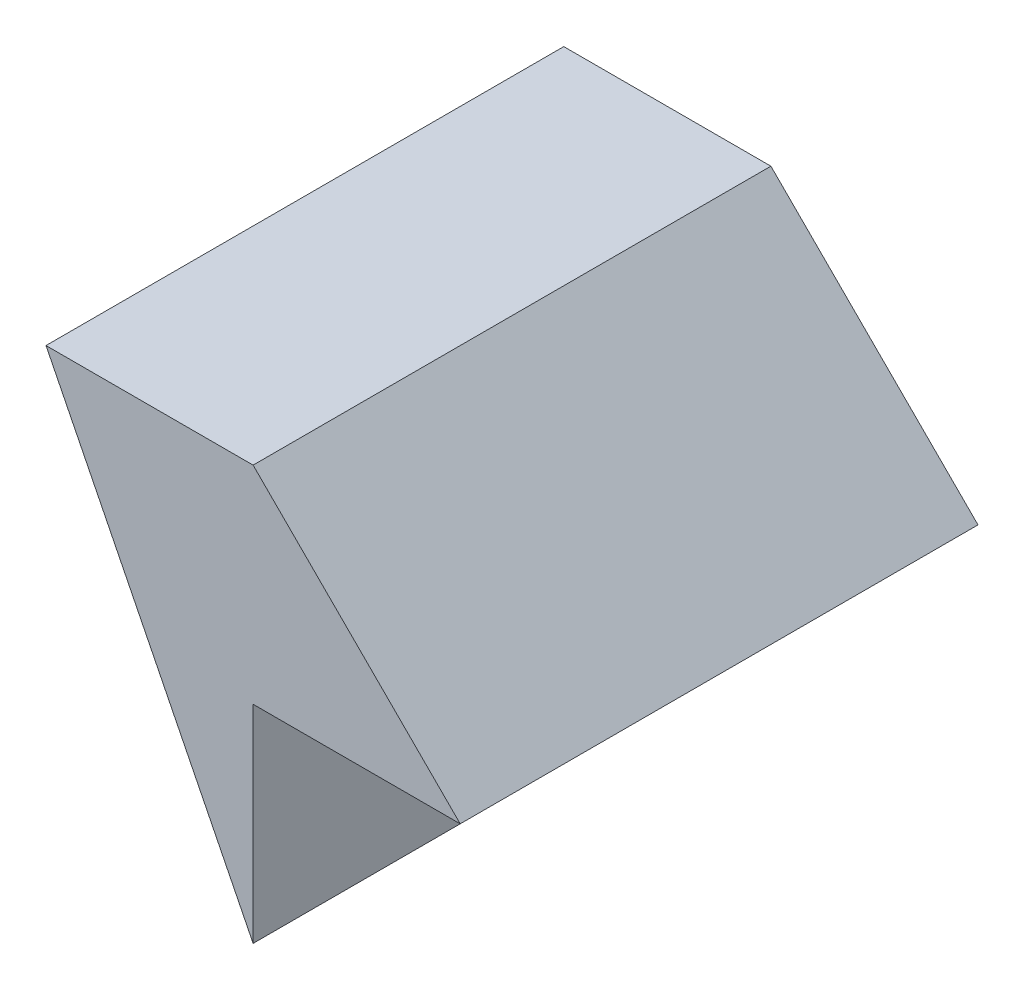
ISO-10303-21;
HEADER;
FILE_DESCRIPTION(('STEP AP214'),'2;1');
FILE_NAME('part.step','',(''),(''),'','','');
FILE_SCHEMA(('AUTOMOTIVE_DESIGN { 1 0 10303 214 1 1 1 1 }'));
ENDSEC;
DATA;
#1=APPLICATION_CONTEXT('core data for automotive mechanical design processes');
#2=APPLICATION_PROTOCOL_DEFINITION('international standard','automotive_design',2000,#1);
#3=PRODUCT_CONTEXT('',#1,'mechanical');
#4=PRODUCT('Part','Part','',(#3));
#5=PRODUCT_RELATED_PRODUCT_CATEGORY('part','',(#4));
#6=PRODUCT_DEFINITION_FORMATION('','',#4);
#7=PRODUCT_DEFINITION_CONTEXT('part definition',#1,'design');
#8=PRODUCT_DEFINITION('design','',#6,#7);
#9=PRODUCT_DEFINITION_SHAPE('','',#8);
#10=(LENGTH_UNIT() NAMED_UNIT(*) SI_UNIT(.MILLI.,.METRE.));
#11=(NAMED_UNIT(*) PLANE_ANGLE_UNIT() SI_UNIT($,.RADIAN.));
#12=(NAMED_UNIT(*) SI_UNIT($,.STERADIAN.) SOLID_ANGLE_UNIT());
#13=UNCERTAINTY_MEASURE_WITH_UNIT(LENGTH_MEASURE(1.E-05),#10,'distance_accuracy_value','');
#14=(GEOMETRIC_REPRESENTATION_CONTEXT(3) GLOBAL_UNCERTAINTY_ASSIGNED_CONTEXT((#13)) GLOBAL_UNIT_ASSIGNED_CONTEXT((#10,
#11,#12)) REPRESENTATION_CONTEXT('',''));
#15=CARTESIAN_POINT('',(0.,0.,0.));
#16=DIRECTION('',(0.,0.,1.));
#17=DIRECTION('',(1.,0.,0.));
#18=AXIS2_PLACEMENT_3D('',#15,#16,#17);
#19=CARTESIAN_POINT('',(0.,-10.,25.));
#20=DIRECTION('',(0.894427190999916,0.447213595499958,0.));
#21=DIRECTION('',(-0.447213595499958,0.894427190999916,0.));
#22=AXIS2_PLACEMENT_3D('',#19,#20,#21);
#23=PLANE('',#22);
#24=DIRECTION('',(0.447213595499958,-0.894427190999916,0.));
#25=VECTOR('',#24,1.);
#26=CARTESIAN_POINT('',(0.,-10.,0.));
#27=LINE('',#26,#25);
#28=CARTESIAN_POINT('',(-10.,10.,0.));
#29=VERTEX_POINT('',#28);
#30=CARTESIAN_POINT('',(0.,-10.,0.));
#31=VERTEX_POINT('',#30);
#32=EDGE_CURVE('E107',#29,#31,#27,.T.);
#33=ORIENTED_EDGE('',*,*,#32,.T.);
#34=DIRECTION('',(0.,0.,-1.));
#35=VECTOR('',#34,1.);
#36=CARTESIAN_POINT('',(0.,-10.,25.));
#37=LINE('',#36,#35);
#38=CARTESIAN_POINT('',(0.,-10.,25.));
#39=VERTEX_POINT('',#38);
#40=EDGE_CURVE('E11',#39,#31,#37,.T.);
#41=ORIENTED_EDGE('',*,*,#40,.F.);
#42=DIRECTION('',(0.447213595499958,-0.894427190999916,0.));
#43=VECTOR('',#42,1.);
#44=CARTESIAN_POINT('',(0.,-10.,25.));
#45=LINE('',#44,#43);
#46=CARTESIAN_POINT('',(-10.,10.,25.));
#47=VERTEX_POINT('',#46);
#48=EDGE_CURVE('E115',#47,#39,#45,.T.);
#49=ORIENTED_EDGE('',*,*,#48,.F.);
#50=DIRECTION('',(0.,0.,-1.));
#51=VECTOR('',#50,1.);
#52=CARTESIAN_POINT('',(-10.,10.,25.));
#53=LINE('',#52,#51);
#54=EDGE_CURVE('E103',#47,#29,#53,.T.);
#55=ORIENTED_EDGE('',*,*,#54,.T.);
#56=EDGE_LOOP('',(#33,#41,#49,#55));
#57=FACE_BOUND('',#56,.T.);
#58=ADVANCED_FACE('F33',(#57),#23,.F.);
#59=CARTESIAN_POINT('',(0.,0.,25.));
#60=DIRECTION('',(-1.,0.,0.));
#61=DIRECTION('',(0.,-1.,0.));
#62=AXIS2_PLACEMENT_3D('',#59,#60,#61);
#63=PLANE('',#62);
#64=DIRECTION('',(0.,1.,0.));
#65=VECTOR('',#64,1.);
#66=CARTESIAN_POINT('',(0.,0.,0.));
#67=LINE('',#66,#65);
#68=CARTESIAN_POINT('',(0.,0.,0.));
#69=VERTEX_POINT('',#68);
#70=EDGE_CURVE('E110',#31,#69,#67,.T.);
#71=ORIENTED_EDGE('',*,*,#70,.T.);
#72=DIRECTION('',(0.,0.,-1.));
#73=VECTOR('',#72,1.);
#74=CARTESIAN_POINT('',(0.,0.,25.));
#75=LINE('',#74,#73);
#76=CARTESIAN_POINT('',(0.,0.,25.));
#77=VERTEX_POINT('',#76);
#78=EDGE_CURVE('E41',#77,#69,#75,.T.);
#79=ORIENTED_EDGE('',*,*,#78,.F.);
#80=DIRECTION('',(0.,1.,0.));
#81=VECTOR('',#80,1.);
#82=CARTESIAN_POINT('',(0.,0.,25.));
#83=LINE('',#82,#81);
#84=EDGE_CURVE('E83',#39,#77,#83,.T.);
#85=ORIENTED_EDGE('',*,*,#84,.F.);
#86=ORIENTED_EDGE('',*,*,#40,.T.);
#87=EDGE_LOOP('',(#71,#79,#85,#86));
#88=FACE_BOUND('',#87,.T.);
#89=ADVANCED_FACE('F134',(#88),#63,.F.);
#90=CARTESIAN_POINT('',(10.,0.,25.));
#91=DIRECTION('',(0.,1.,0.));
#92=DIRECTION('',(-1.,0.,0.));
#93=AXIS2_PLACEMENT_3D('',#90,#91,#92);
#94=PLANE('',#93);
#95=DIRECTION('',(1.,0.,0.));
#96=VECTOR('',#95,1.);
#97=CARTESIAN_POINT('',(10.,0.,0.));
#98=LINE('',#97,#96);
#99=CARTESIAN_POINT('',(10.,0.,0.));
#100=VERTEX_POINT('',#99);
#101=EDGE_CURVE('E98',#69,#100,#98,.T.);
#102=ORIENTED_EDGE('',*,*,#101,.T.);
#103=DIRECTION('',(0.,0.,-1.));
#104=VECTOR('',#103,1.);
#105=CARTESIAN_POINT('',(10.,0.,25.));
#106=LINE('',#105,#104);
#107=CARTESIAN_POINT('',(10.,0.,25.));
#108=VERTEX_POINT('',#107);
#109=EDGE_CURVE('E95',#108,#100,#106,.T.);
#110=ORIENTED_EDGE('',*,*,#109,.F.);
#111=DIRECTION('',(1.,0.,0.));
#112=VECTOR('',#111,1.);
#113=CARTESIAN_POINT('',(10.,0.,25.));
#114=LINE('',#113,#112);
#115=EDGE_CURVE('E87',#77,#108,#114,.T.);
#116=ORIENTED_EDGE('',*,*,#115,.F.);
#117=ORIENTED_EDGE('',*,*,#78,.T.);
#118=EDGE_LOOP('',(#102,#110,#116,#117));
#119=FACE_BOUND('',#118,.T.);
#120=ADVANCED_FACE('F96',(#119),#94,.F.);
#121=CARTESIAN_POINT('',(0.,10.,25.));
#122=DIRECTION('',(-0.707106781186547,-0.707106781186548,0.));
#123=DIRECTION('',(0.707106781186548,-0.707106781186547,0.));
#124=AXIS2_PLACEMENT_3D('',#121,#122,#123);
#125=PLANE('',#124);
#126=DIRECTION('',(-0.707106781186548,0.707106781186547,0.));
#127=VECTOR('',#126,1.);
#128=CARTESIAN_POINT('',(0.,10.,0.));
#129=LINE('',#128,#127);
#130=CARTESIAN_POINT('',(0.,10.,0.));
#131=VERTEX_POINT('',#130);
#132=EDGE_CURVE('E69',#100,#131,#129,.T.);
#133=ORIENTED_EDGE('',*,*,#132,.T.);
#134=DIRECTION('',(0.,0.,-1.));
#135=VECTOR('',#134,1.);
#136=CARTESIAN_POINT('',(0.,10.,25.));
#137=LINE('',#136,#135);
#138=CARTESIAN_POINT('',(0.,10.,25.));
#139=VERTEX_POINT('',#138);
#140=EDGE_CURVE('E99',#139,#131,#137,.T.);
#141=ORIENTED_EDGE('',*,*,#140,.F.);
#142=DIRECTION('',(-0.707106781186548,0.707106781186547,0.));
#143=VECTOR('',#142,1.);
#144=CARTESIAN_POINT('',(0.,10.,25.));
#145=LINE('',#144,#143);
#146=EDGE_CURVE('E91',#108,#139,#145,.T.);
#147=ORIENTED_EDGE('',*,*,#146,.F.);
#148=ORIENTED_EDGE('',*,*,#109,.T.);
#149=EDGE_LOOP('',(#133,#141,#147,#148));
#150=FACE_BOUND('',#149,.T.);
#151=ADVANCED_FACE('F101',(#150),#125,.F.);
#152=CARTESIAN_POINT('',(-10.,10.,25.));
#153=DIRECTION('',(0.,-1.,0.));
#154=DIRECTION('',(0.,0.,-1.));
#155=AXIS2_PLACEMENT_3D('',#152,#153,#154);
#156=PLANE('',#155);
#157=DIRECTION('',(-1.,0.,0.));
#158=VECTOR('',#157,1.);
#159=CARTESIAN_POINT('',(-10.,10.,0.));
#160=LINE('',#159,#158);
#161=EDGE_CURVE('E75',#131,#29,#160,.T.);
#162=ORIENTED_EDGE('',*,*,#161,.T.);
#163=ORIENTED_EDGE('',*,*,#54,.F.);
#164=DIRECTION('',(-1.,0.,0.));
#165=VECTOR('',#164,1.);
#166=CARTESIAN_POINT('',(-10.,10.,25.));
#167=LINE('',#166,#165);
#168=EDGE_CURVE('E49',#139,#47,#167,.T.);
#169=ORIENTED_EDGE('',*,*,#168,.F.);
#170=ORIENTED_EDGE('',*,*,#140,.T.);
#171=EDGE_LOOP('',(#162,#163,#169,#170));
#172=FACE_BOUND('',#171,.T.);
#173=ADVANCED_FACE('F123',(#172),#156,.F.);
#174=CARTESIAN_POINT('',(0.,0.,25.));
#175=DIRECTION('',(0.,0.,-1.));
#176=DIRECTION('',(-1.,0.,0.));
#177=AXIS2_PLACEMENT_3D('',#174,#175,#176);
#178=PLANE('',#177);
#179=ORIENTED_EDGE('',*,*,#48,.T.);
#180=ORIENTED_EDGE('',*,*,#84,.T.);
#181=ORIENTED_EDGE('',*,*,#115,.T.);
#182=ORIENTED_EDGE('',*,*,#146,.T.);
#183=ORIENTED_EDGE('',*,*,#168,.T.);
#184=EDGE_LOOP('',(#179,#180,#181,#182,#183));
#185=FACE_BOUND('',#184,.T.);
#186=ADVANCED_FACE('F89',(#185),#178,.F.);
#187=CARTESIAN_POINT('',(0.,0.,0.));
#188=DIRECTION('',(0.,0.,-1.));
#189=DIRECTION('',(-1.,0.,0.));
#190=AXIS2_PLACEMENT_3D('',#187,#188,#189);
#191=PLANE('',#190);
#192=ORIENTED_EDGE('',*,*,#32,.F.);
#193=ORIENTED_EDGE('',*,*,#161,.F.);
#194=ORIENTED_EDGE('',*,*,#132,.F.);
#195=ORIENTED_EDGE('',*,*,#101,.F.);
#196=ORIENTED_EDGE('',*,*,#70,.F.);
#197=EDGE_LOOP('',(#192,#193,#194,#195,#196));
#198=FACE_BOUND('',#197,.T.);
#199=ADVANCED_FACE('F119',(#198),#191,.T.);
#200=CLOSED_SHELL('',(#58,#89,#120,#151,#173,#186,#199));
#201=MANIFOLD_SOLID_BREP('B2',#200);
#202=ADVANCED_BREP_SHAPE_REPRESENTATION('',(#18,#201),#14);
#203=SHAPE_DEFINITION_REPRESENTATION(#9,#202);
ENDSEC;
END-ISO-10303-21;
